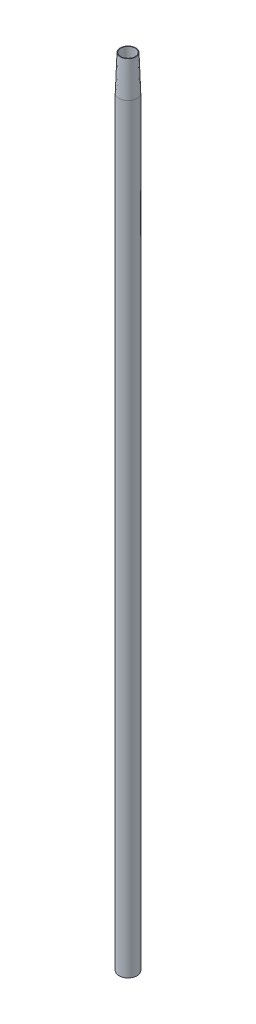
ISO-10303-21;
HEADER;
FILE_DESCRIPTION(('STEP AP214'),'2;1');
FILE_NAME('part.step','',(''),(''),'','','');
FILE_SCHEMA(('AUTOMOTIVE_DESIGN { 1 0 10303 214 1 1 1 1 }'));
ENDSEC;
DATA;
#1=APPLICATION_CONTEXT('core data for automotive mechanical design processes');
#2=APPLICATION_PROTOCOL_DEFINITION('international standard','automotive_design',2000,#1);
#3=PRODUCT_CONTEXT('',#1,'mechanical');
#4=PRODUCT('Part','Part','',(#3));
#5=PRODUCT_RELATED_PRODUCT_CATEGORY('part','',(#4));
#6=PRODUCT_DEFINITION_FORMATION('','',#4);
#7=PRODUCT_DEFINITION_CONTEXT('part definition',#1,'design');
#8=PRODUCT_DEFINITION('design','',#6,#7);
#9=PRODUCT_DEFINITION_SHAPE('','',#8);
#10=(LENGTH_UNIT() NAMED_UNIT(*) SI_UNIT(.MILLI.,.METRE.));
#11=(NAMED_UNIT(*) PLANE_ANGLE_UNIT() SI_UNIT($,.RADIAN.));
#12=(NAMED_UNIT(*) SI_UNIT($,.STERADIAN.) SOLID_ANGLE_UNIT());
#13=UNCERTAINTY_MEASURE_WITH_UNIT(LENGTH_MEASURE(1.E-05),#10,'distance_accuracy_value','');
#14=(GEOMETRIC_REPRESENTATION_CONTEXT(3) GLOBAL_UNCERTAINTY_ASSIGNED_CONTEXT((#13)) GLOBAL_UNIT_ASSIGNED_CONTEXT((#10,
#11,#12)) REPRESENTATION_CONTEXT('',''));
#15=CARTESIAN_POINT('',(0.,0.,0.));
#16=DIRECTION('',(0.,0.,1.));
#17=DIRECTION('',(1.,0.,0.));
#18=AXIS2_PLACEMENT_3D('',#15,#16,#17);
#19=CARTESIAN_POINT('',(0.,225.,0.));
#20=DIRECTION('',(0.,1.,0.));
#21=DIRECTION('',(0.,0.,1.));
#22=AXIS2_PLACEMENT_3D('',#19,#20,#21);
#23=PLANE('',#22);
#24=CARTESIAN_POINT('',(0.,225.,0.));
#25=DIRECTION('',(0.,1.,0.));
#26=DIRECTION('',(0.,0.,1.));
#27=AXIS2_PLACEMENT_3D('',#24,#25,#26);
#28=CIRCLE('',#27,2.20579230508253);
#29=CARTESIAN_POINT('',(0.,225.,2.20579230508253));
#30=VERTEX_POINT('',#29);
#31=EDGE_CURVE('E40',#30,#30,#28,.T.);
#32=ORIENTED_EDGE('',*,*,#31,.T.);
#33=EDGE_LOOP('',(#32));
#34=FACE_BOUND('',#33,.T.);
#35=CARTESIAN_POINT('',(0.,225.,0.));
#36=DIRECTION('',(0.,1.,0.));
#37=DIRECTION('',(0.,0.,1.));
#38=AXIS2_PLACEMENT_3D('',#35,#36,#37);
#39=CIRCLE('',#38,2.055);
#40=CARTESIAN_POINT('',(0.,225.,2.055));
#41=VERTEX_POINT('',#40);
#42=EDGE_CURVE('E48',#41,#41,#39,.T.);
#43=ORIENTED_EDGE('',*,*,#42,.F.);
#44=EDGE_LOOP('',(#43));
#45=FACE_BOUND('',#44,.T.);
#46=ADVANCED_FACE('F33',(#34,#45),#23,.T.);
#47=CARTESIAN_POINT('',(0.,0.,0.));
#48=DIRECTION('',(0.,1.,0.));
#49=DIRECTION('',(0.,0.,1.));
#50=AXIS2_PLACEMENT_3D('',#47,#48,#49);
#51=PLANE('',#50);
#52=CARTESIAN_POINT('',(0.,0.,0.));
#53=DIRECTION('',(0.,1.,0.));
#54=DIRECTION('',(0.,0.,1.));
#55=AXIS2_PLACEMENT_3D('',#52,#53,#54);
#56=CIRCLE('',#55,2.555);
#57=CARTESIAN_POINT('',(0.,0.,2.555));
#58=VERTEX_POINT('',#57);
#59=EDGE_CURVE('E44',#58,#58,#56,.T.);
#60=ORIENTED_EDGE('',*,*,#59,.F.);
#61=EDGE_LOOP('',(#60));
#62=FACE_BOUND('',#61,.T.);
#63=CARTESIAN_POINT('',(0.,0.,0.));
#64=DIRECTION('',(0.,1.,0.));
#65=DIRECTION('',(0.,0.,1.));
#66=AXIS2_PLACEMENT_3D('',#63,#64,#65);
#67=CIRCLE('',#66,2.055);
#68=CARTESIAN_POINT('',(0.,0.,2.055));
#69=VERTEX_POINT('',#68);
#70=EDGE_CURVE('E51',#69,#69,#67,.T.);
#71=ORIENTED_EDGE('',*,*,#70,.T.);
#72=EDGE_LOOP('',(#71));
#73=FACE_BOUND('',#72,.T.);
#74=ADVANCED_FACE('F61',(#62,#73),#51,.F.);
#75=CARTESIAN_POINT('',(0.,225.,0.));
#76=DIRECTION('',(0.,-1.,0.));
#77=DIRECTION('',(0.,0.,-1.));
#78=AXIS2_PLACEMENT_3D('',#75,#76,#77);
#79=CYLINDRICAL_SURFACE('',#78,2.555);
#80=CARTESIAN_POINT('',(0.,214.999999999999,0.));
#81=DIRECTION('',(0.,1.,0.));
#82=DIRECTION('',(0.,0.,1.));
#83=AXIS2_PLACEMENT_3D('',#80,#81,#82);
#84=CIRCLE('',#83,2.555);
#85=CARTESIAN_POINT('',(0.,214.999999999999,2.555));
#86=VERTEX_POINT('',#85);
#87=EDGE_CURVE('E10',#86,#86,#84,.F.);
#88=ORIENTED_EDGE('',*,*,#87,.T.);
#89=EDGE_LOOP('',(#88));
#90=FACE_BOUND('',#89,.T.);
#91=ORIENTED_EDGE('',*,*,#59,.T.);
#92=EDGE_LOOP('',(#91));
#93=FACE_BOUND('',#92,.T.);
#94=ADVANCED_FACE('F66',(#90,#93),#79,.T.);
#95=CARTESIAN_POINT('',(0.,225.,0.));
#96=DIRECTION('',(0.,-1.,0.));
#97=DIRECTION('',(0.,0.,-1.));
#98=AXIS2_PLACEMENT_3D('',#95,#96,#97);
#99=CYLINDRICAL_SURFACE('',#98,2.055);
#100=ORIENTED_EDGE('',*,*,#42,.T.);
#101=EDGE_LOOP('',(#100));
#102=FACE_BOUND('',#101,.T.);
#103=ORIENTED_EDGE('',*,*,#70,.F.);
#104=EDGE_LOOP('',(#103));
#105=FACE_BOUND('',#104,.T.);
#106=ADVANCED_FACE('F57',(#102,#105),#99,.F.);
#107=CARTESIAN_POINT('',(0.,225.,0.));
#108=DIRECTION('',(0.,-1.,0.));
#109=DIRECTION('',(0.,0.,-1.));
#110=AXIS2_PLACEMENT_3D('',#107,#108,#109);
#111=CONICAL_SURFACE('',#110,2.20579230508253,0.034906585039884);
#112=ORIENTED_EDGE('',*,*,#87,.F.);
#113=EDGE_LOOP('',(#112));
#114=FACE_BOUND('',#113,.T.);
#115=ORIENTED_EDGE('',*,*,#31,.F.);
#116=EDGE_LOOP('',(#115));
#117=FACE_BOUND('',#116,.T.);
#118=ADVANCED_FACE('F35',(#114,#117),#111,.T.);
#119=CLOSED_SHELL('',(#46,#74,#94,#106,#118));
#120=MANIFOLD_SOLID_BREP('B2',#119);
#121=ADVANCED_BREP_SHAPE_REPRESENTATION('',(#18,#120),#14);
#122=SHAPE_DEFINITION_REPRESENTATION(#9,#121);
ENDSEC;
END-ISO-10303-21;
